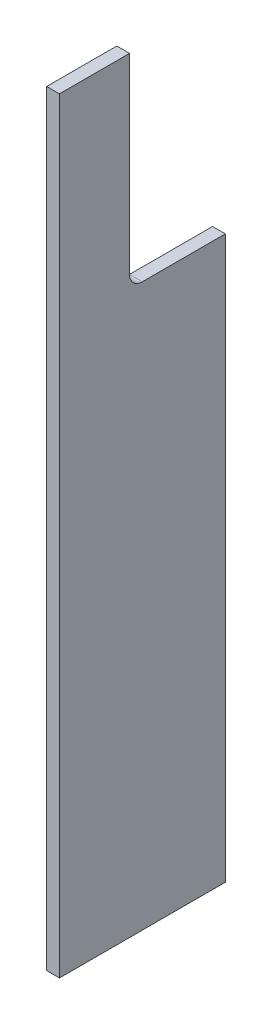
ISO-10303-21;
HEADER;
FILE_DESCRIPTION(('STEP AP214'),'2;1');
FILE_NAME('part.step','',(''),(''),'','','');
FILE_SCHEMA(('AUTOMOTIVE_DESIGN { 1 0 10303 214 1 1 1 1 }'));
ENDSEC;
DATA;
#1=APPLICATION_CONTEXT('core data for automotive mechanical design processes');
#2=APPLICATION_PROTOCOL_DEFINITION('international standard','automotive_design',2000,#1);
#3=PRODUCT_CONTEXT('',#1,'mechanical');
#4=PRODUCT('Part','Part','',(#3));
#5=PRODUCT_RELATED_PRODUCT_CATEGORY('part','',(#4));
#6=PRODUCT_DEFINITION_FORMATION('','',#4);
#7=PRODUCT_DEFINITION_CONTEXT('part definition',#1,'design');
#8=PRODUCT_DEFINITION('design','',#6,#7);
#9=PRODUCT_DEFINITION_SHAPE('','',#8);
#10=(LENGTH_UNIT() NAMED_UNIT(*) SI_UNIT(.MILLI.,.METRE.));
#11=(NAMED_UNIT(*) PLANE_ANGLE_UNIT() SI_UNIT($,.RADIAN.));
#12=(NAMED_UNIT(*) SI_UNIT($,.STERADIAN.) SOLID_ANGLE_UNIT());
#13=UNCERTAINTY_MEASURE_WITH_UNIT(LENGTH_MEASURE(1.E-05),#10,'distance_accuracy_value','');
#14=(GEOMETRIC_REPRESENTATION_CONTEXT(3) GLOBAL_UNCERTAINTY_ASSIGNED_CONTEXT((#13)) GLOBAL_UNIT_ASSIGNED_CONTEXT((#10,
#11,#12)) REPRESENTATION_CONTEXT('',''));
#15=CARTESIAN_POINT('',(0.,0.,0.));
#16=DIRECTION('',(0.,0.,1.));
#17=DIRECTION('',(1.,0.,0.));
#18=AXIS2_PLACEMENT_3D('',#15,#16,#17);
#19=CARTESIAN_POINT('',(-155.641983178825,600.,730.057294800343));
#20=DIRECTION('',(-1.,0.,0.));
#21=DIRECTION('',(0.,-1.,0.));
#22=AXIS2_PLACEMENT_3D('',#19,#20,#21);
#23=PLANE('',#22);
#24=DIRECTION('',(0.,1.,0.));
#25=VECTOR('',#24,1.);
#26=CARTESIAN_POINT('',(-155.641983178825,600.,0.));
#27=LINE('',#26,#25);
#28=CARTESIAN_POINT('',(-155.641983178825,0.,0.));
#29=VERTEX_POINT('',#28);
#30=CARTESIAN_POINT('',(-155.641983178825,440.,0.));
#31=VERTEX_POINT('',#30);
#32=EDGE_CURVE('E141',#29,#31,#27,.T.);
#33=ORIENTED_EDGE('',*,*,#32,.T.);
#34=DIRECTION('',(0.,0.,-1.));
#35=VECTOR('',#34,1.);
#36=CARTESIAN_POINT('',(-155.641983178825,440.,0.));
#37=LINE('',#36,#35);
#38=CARTESIAN_POINT('',(-155.641983178825,440.,65.0459842801732));
#39=VERTEX_POINT('',#38);
#40=EDGE_CURVE('E48',#39,#31,#37,.T.);
#41=ORIENTED_EDGE('',*,*,#40,.F.);
#42=CARTESIAN_POINT('',(-155.641983178825,450.,65.0459842801732));
#43=DIRECTION('',(1.,0.,0.));
#44=DIRECTION('',(0.,-1.,0.));
#45=AXIS2_PLACEMENT_3D('',#42,#43,#44);
#46=CIRCLE('',#45,10.);
#47=CARTESIAN_POINT('',(-155.641983178825,450.,75.0459842801732));
#48=VERTEX_POINT('',#47);
#49=EDGE_CURVE('E132',#48,#39,#46,.T.);
#50=ORIENTED_EDGE('',*,*,#49,.F.);
#51=DIRECTION('',(0.,-1.,0.));
#52=VECTOR('',#51,1.);
#53=CARTESIAN_POINT('',(-155.641983178825,600.,75.0459842801732));
#54=LINE('',#53,#52);
#55=CARTESIAN_POINT('',(-155.641983178825,600.,75.0459842801732));
#56=VERTEX_POINT('',#55);
#57=EDGE_CURVE('E130',#56,#48,#54,.T.);
#58=ORIENTED_EDGE('',*,*,#57,.F.);
#59=DIRECTION('',(0.,0.,-1.));
#60=VECTOR('',#59,1.);
#61=CARTESIAN_POINT('',(-155.641983178825,600.,730.057294800343));
#62=LINE('',#61,#60);
#63=CARTESIAN_POINT('',(-155.641983178825,600.,129.973967253243));
#64=VERTEX_POINT('',#63);
#65=EDGE_CURVE('E113',#64,#56,#62,.T.);
#66=ORIENTED_EDGE('',*,*,#65,.F.);
#67=DIRECTION('',(0.,1.,0.));
#68=VECTOR('',#67,1.);
#69=CARTESIAN_POINT('',(-155.641983178825,600.,129.973967253243));
#70=LINE('',#69,#68);
#71=CARTESIAN_POINT('',(-155.641983178825,-3.33066907387547E-13,129.973967253243));
#72=VERTEX_POINT('',#71);
#73=EDGE_CURVE('E36',#72,#64,#70,.T.);
#74=ORIENTED_EDGE('',*,*,#73,.F.);
#75=DIRECTION('',(0.,0.,-1.));
#76=VECTOR('',#75,1.);
#77=CARTESIAN_POINT('',(-155.641983178825,0.,730.057294800343));
#78=LINE('',#77,#76);
#79=EDGE_CURVE('E121',#72,#29,#78,.T.);
#80=ORIENTED_EDGE('',*,*,#79,.T.);
#81=EDGE_LOOP('',(#33,#41,#50,#58,#66,#74,#80));
#82=FACE_BOUND('',#81,.T.);
#83=ADVANCED_FACE('F33',(#82),#23,.F.);
#84=CARTESIAN_POINT('',(-155.641983178825,600.,730.057294800343));
#85=DIRECTION('',(0.,-1.,0.));
#86=DIRECTION('',(0.,0.,-1.));
#87=AXIS2_PLACEMENT_3D('',#84,#85,#86);
#88=PLANE('',#87);
#89=ORIENTED_EDGE('',*,*,#65,.T.);
#90=DIRECTION('',(1.,0.,0.));
#91=VECTOR('',#90,1.);
#92=CARTESIAN_POINT('',(-165.641983178825,600.,75.0459842801732));
#93=LINE('',#92,#91);
#94=CARTESIAN_POINT('',(-165.641983178825,600.,75.0459842801732));
#95=VERTEX_POINT('',#94);
#96=EDGE_CURVE('E98',#95,#56,#93,.T.);
#97=ORIENTED_EDGE('',*,*,#96,.F.);
#98=DIRECTION('',(0.,0.,-1.));
#99=VECTOR('',#98,1.);
#100=CARTESIAN_POINT('',(-165.641983178825,600.,730.057294800343));
#101=LINE('',#100,#99);
#102=CARTESIAN_POINT('',(-165.641983178825,600.,129.973967253243));
#103=VERTEX_POINT('',#102);
#104=EDGE_CURVE('E111',#103,#95,#101,.T.);
#105=ORIENTED_EDGE('',*,*,#104,.F.);
#106=DIRECTION('',(-1.,0.,0.));
#107=VECTOR('',#106,1.);
#108=CARTESIAN_POINT('',(-155.641983178831,600.,129.973967253243));
#109=LINE('',#108,#107);
#110=EDGE_CURVE('E63',#64,#103,#109,.T.);
#111=ORIENTED_EDGE('',*,*,#110,.F.);
#112=EDGE_LOOP('',(#89,#97,#105,#111));
#113=FACE_BOUND('',#112,.T.);
#114=ADVANCED_FACE('F110',(#113),#88,.F.);
#115=CARTESIAN_POINT('',(-165.641983178825,600.,730.057294800343));
#116=DIRECTION('',(1.,0.,0.));
#117=DIRECTION('',(0.,1.,0.));
#118=AXIS2_PLACEMENT_3D('',#115,#116,#117);
#119=PLANE('',#118);
#120=CARTESIAN_POINT('',(-165.641983178825,450.,65.0459842801732));
#121=DIRECTION('',(1.,0.,0.));
#122=DIRECTION('',(0.,-1.,0.));
#123=AXIS2_PLACEMENT_3D('',#120,#121,#122);
#124=CIRCLE('',#123,10.);
#125=CARTESIAN_POINT('',(-165.641983178825,450.,75.0459842801732));
#126=VERTEX_POINT('',#125);
#127=CARTESIAN_POINT('',(-165.641983178825,440.,65.0459842801732));
#128=VERTEX_POINT('',#127);
#129=EDGE_CURVE('E105',#126,#128,#124,.T.);
#130=ORIENTED_EDGE('',*,*,#129,.T.);
#131=DIRECTION('',(0.,0.,-1.));
#132=VECTOR('',#131,1.);
#133=CARTESIAN_POINT('',(-165.641983178825,440.,0.));
#134=LINE('',#133,#132);
#135=CARTESIAN_POINT('',(-165.641983178825,440.,0.));
#136=VERTEX_POINT('',#135);
#137=EDGE_CURVE('E114',#128,#136,#134,.T.);
#138=ORIENTED_EDGE('',*,*,#137,.T.);
#139=DIRECTION('',(0.,-1.,0.));
#140=VECTOR('',#139,1.);
#141=CARTESIAN_POINT('',(-165.641983178825,600.,0.));
#142=LINE('',#141,#140);
#143=CARTESIAN_POINT('',(-165.641983178825,0.,0.));
#144=VERTEX_POINT('',#143);
#145=EDGE_CURVE('E146',#136,#144,#142,.T.);
#146=ORIENTED_EDGE('',*,*,#145,.T.);
#147=DIRECTION('',(0.,0.,-1.));
#148=VECTOR('',#147,1.);
#149=CARTESIAN_POINT('',(-165.641983178825,0.,730.057294800343));
#150=LINE('',#149,#148);
#151=CARTESIAN_POINT('',(-165.641983178825,0.,129.973967253243));
#152=VERTEX_POINT('',#151);
#153=EDGE_CURVE('E117',#152,#144,#150,.T.);
#154=ORIENTED_EDGE('',*,*,#153,.F.);
#155=DIRECTION('',(0.,-1.,0.));
#156=VECTOR('',#155,1.);
#157=CARTESIAN_POINT('',(-165.641983178825,600.,129.973967253244));
#158=LINE('',#157,#156);
#159=EDGE_CURVE('E66',#103,#152,#158,.T.);
#160=ORIENTED_EDGE('',*,*,#159,.F.);
#161=ORIENTED_EDGE('',*,*,#104,.T.);
#162=DIRECTION('',(0.,-1.,0.));
#163=VECTOR('',#162,1.);
#164=CARTESIAN_POINT('',(-165.641983178825,600.,75.0459842801732));
#165=LINE('',#164,#163);
#166=EDGE_CURVE('E94',#95,#126,#165,.T.);
#167=ORIENTED_EDGE('',*,*,#166,.T.);
#168=EDGE_LOOP('',(#130,#138,#146,#154,#160,#161,#167));
#169=FACE_BOUND('',#168,.T.);
#170=ADVANCED_FACE('F116',(#169),#119,.F.);
#171=CARTESIAN_POINT('',(-155.641983178825,0.,730.057294800343));
#172=DIRECTION('',(0.,1.,0.));
#173=DIRECTION('',(-1.,0.,0.));
#174=AXIS2_PLACEMENT_3D('',#171,#172,#173);
#175=PLANE('',#174);
#176=DIRECTION('',(1.,0.,0.));
#177=VECTOR('',#176,1.);
#178=CARTESIAN_POINT('',(-155.641983178831,0.,129.973967253243));
#179=LINE('',#178,#177);
#180=EDGE_CURVE('E11',#152,#72,#179,.T.);
#181=ORIENTED_EDGE('',*,*,#180,.F.);
#182=ORIENTED_EDGE('',*,*,#153,.T.);
#183=DIRECTION('',(1.,0.,0.));
#184=VECTOR('',#183,1.);
#185=CARTESIAN_POINT('',(-155.641983178825,0.,0.));
#186=LINE('',#185,#184);
#187=EDGE_CURVE('E148',#144,#29,#186,.T.);
#188=ORIENTED_EDGE('',*,*,#187,.T.);
#189=ORIENTED_EDGE('',*,*,#79,.F.);
#190=EDGE_LOOP('',(#181,#182,#188,#189));
#191=FACE_BOUND('',#190,.T.);
#192=ADVANCED_FACE('F153',(#191),#175,.F.);
#193=CARTESIAN_POINT('',(0.,0.,0.));
#194=DIRECTION('',(0.,0.,-1.));
#195=DIRECTION('',(-1.,0.,0.));
#196=AXIS2_PLACEMENT_3D('',#193,#194,#195);
#197=PLANE('',#196);
#198=DIRECTION('',(1.,0.,0.));
#199=VECTOR('',#198,1.);
#200=CARTESIAN_POINT('',(-165.641983178825,440.,0.));
#201=LINE('',#200,#199);
#202=EDGE_CURVE('E139',#136,#31,#201,.T.);
#203=ORIENTED_EDGE('',*,*,#202,.T.);
#204=ORIENTED_EDGE('',*,*,#32,.F.);
#205=ORIENTED_EDGE('',*,*,#187,.F.);
#206=ORIENTED_EDGE('',*,*,#145,.F.);
#207=EDGE_LOOP('',(#203,#204,#205,#206));
#208=FACE_BOUND('',#207,.T.);
#209=ADVANCED_FACE('F156',(#208),#197,.T.);
#210=CARTESIAN_POINT('',(-155.641983178825,-3.33066907387547E-13,129.973967253243));
#211=DIRECTION('',(0.,0.,1.));
#212=DIRECTION('',(-1.,0.,0.));
#213=AXIS2_PLACEMENT_3D('',#210,#211,#212);
#214=PLANE('',#213);
#215=ORIENTED_EDGE('',*,*,#110,.T.);
#216=ORIENTED_EDGE('',*,*,#159,.T.);
#217=ORIENTED_EDGE('',*,*,#180,.T.);
#218=ORIENTED_EDGE('',*,*,#73,.T.);
#219=EDGE_LOOP('',(#215,#216,#217,#218));
#220=FACE_BOUND('',#219,.T.);
#221=ADVANCED_FACE('F125',(#220),#214,.T.);
#222=CARTESIAN_POINT('',(-165.641983178825,440.,0.));
#223=DIRECTION('',(0.,-1.,0.));
#224=DIRECTION('',(0.,0.,-1.));
#225=AXIS2_PLACEMENT_3D('',#222,#223,#224);
#226=PLANE('',#225);
#227=ORIENTED_EDGE('',*,*,#40,.T.);
#228=ORIENTED_EDGE('',*,*,#202,.F.);
#229=ORIENTED_EDGE('',*,*,#137,.F.);
#230=DIRECTION('',(1.,0.,0.));
#231=VECTOR('',#230,1.);
#232=CARTESIAN_POINT('',(-165.641983178825,440.,65.0459842801732));
#233=LINE('',#232,#231);
#234=EDGE_CURVE('E142',#128,#39,#233,.T.);
#235=ORIENTED_EDGE('',*,*,#234,.T.);
#236=EDGE_LOOP('',(#227,#228,#229,#235));
#237=FACE_BOUND('',#236,.T.);
#238=ADVANCED_FACE('F159',(#237),#226,.F.);
#239=CARTESIAN_POINT('',(-165.641983178825,450.,65.0459842801732));
#240=DIRECTION('',(1.,0.,0.));
#241=DIRECTION('',(0.,1.,0.));
#242=AXIS2_PLACEMENT_3D('',#239,#240,#241);
#243=CYLINDRICAL_SURFACE('',#242,10.);
#244=ORIENTED_EDGE('',*,*,#49,.T.);
#245=ORIENTED_EDGE('',*,*,#234,.F.);
#246=ORIENTED_EDGE('',*,*,#129,.F.);
#247=DIRECTION('',(1.,0.,0.));
#248=VECTOR('',#247,1.);
#249=CARTESIAN_POINT('',(-165.641983178825,450.,75.0459842801732));
#250=LINE('',#249,#248);
#251=EDGE_CURVE('E100',#126,#48,#250,.T.);
#252=ORIENTED_EDGE('',*,*,#251,.T.);
#253=EDGE_LOOP('',(#244,#245,#246,#252));
#254=FACE_BOUND('',#253,.T.);
#255=ADVANCED_FACE('F161',(#254),#243,.F.);
#256=CARTESIAN_POINT('',(-165.641983178825,600.,75.0459842801732));
#257=DIRECTION('',(0.,0.,1.));
#258=DIRECTION('',(0.,-1.,0.));
#259=AXIS2_PLACEMENT_3D('',#256,#257,#258);
#260=PLANE('',#259);
#261=ORIENTED_EDGE('',*,*,#57,.T.);
#262=ORIENTED_EDGE('',*,*,#251,.F.);
#263=ORIENTED_EDGE('',*,*,#166,.F.);
#264=ORIENTED_EDGE('',*,*,#96,.T.);
#265=EDGE_LOOP('',(#261,#262,#263,#264));
#266=FACE_BOUND('',#265,.T.);
#267=ADVANCED_FACE('F97',(#266),#260,.F.);
#268=CLOSED_SHELL('',(#83,#114,#170,#192,#209,#221,#238,#255,#267));
#269=MANIFOLD_SOLID_BREP('B2',#268);
#270=ADVANCED_BREP_SHAPE_REPRESENTATION('',(#18,#269),#14);
#271=SHAPE_DEFINITION_REPRESENTATION(#9,#270);
ENDSEC;
END-ISO-10303-21;
